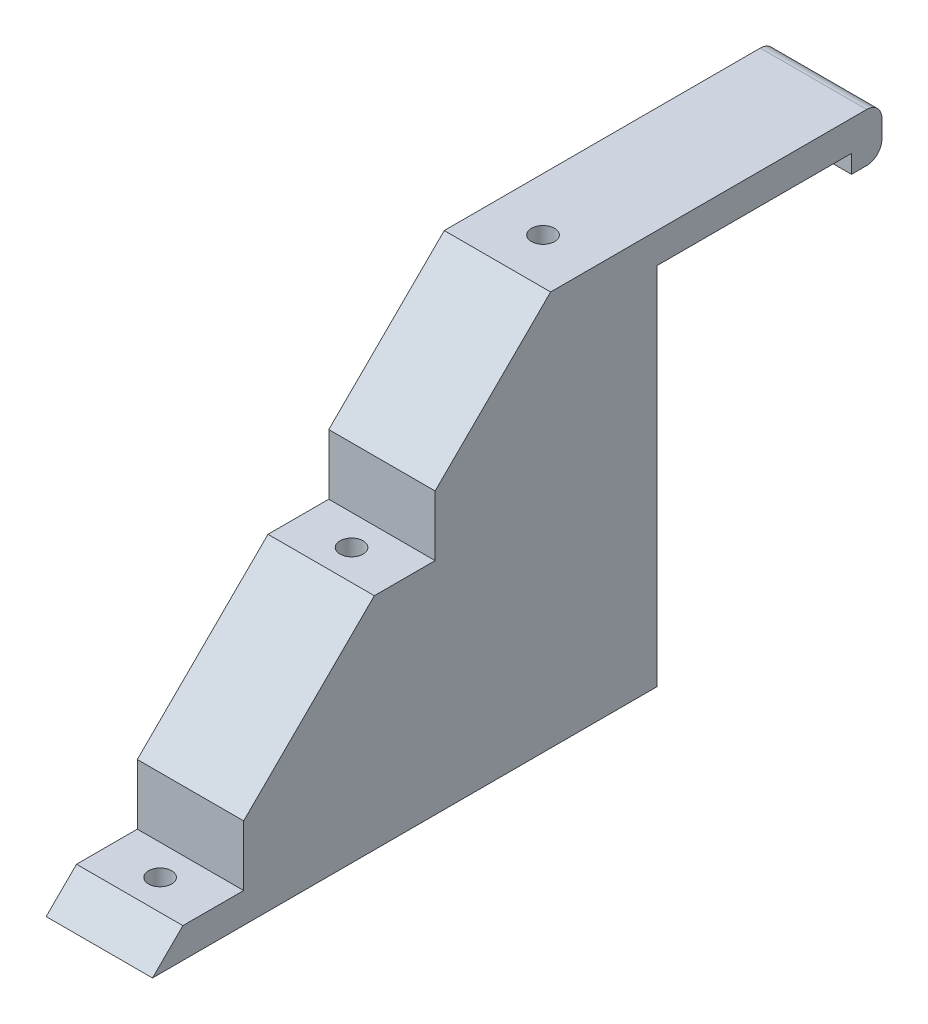
ISO-10303-21;
HEADER;
FILE_DESCRIPTION(('STEP AP214'),'2;1');
FILE_NAME('part.step','',(''),(''),'','','');
FILE_SCHEMA(('AUTOMOTIVE_DESIGN { 1 0 10303 214 1 1 1 1 }'));
ENDSEC;
DATA;
#1=APPLICATION_CONTEXT('core data for automotive mechanical design processes');
#2=APPLICATION_PROTOCOL_DEFINITION('international standard','automotive_design',2000,#1);
#3=PRODUCT_CONTEXT('',#1,'mechanical');
#4=PRODUCT('Part','Part','',(#3));
#5=PRODUCT_RELATED_PRODUCT_CATEGORY('part','',(#4));
#6=PRODUCT_DEFINITION_FORMATION('','',#4);
#7=PRODUCT_DEFINITION_CONTEXT('part definition',#1,'design');
#8=PRODUCT_DEFINITION('design','',#6,#7);
#9=PRODUCT_DEFINITION_SHAPE('','',#8);
#10=(LENGTH_UNIT() NAMED_UNIT(*) SI_UNIT(.MILLI.,.METRE.));
#11=(NAMED_UNIT(*) PLANE_ANGLE_UNIT() SI_UNIT($,.RADIAN.));
#12=(NAMED_UNIT(*) SI_UNIT($,.STERADIAN.) SOLID_ANGLE_UNIT());
#13=UNCERTAINTY_MEASURE_WITH_UNIT(LENGTH_MEASURE(1.E-05),#10,'distance_accuracy_value','');
#14=(GEOMETRIC_REPRESENTATION_CONTEXT(3) GLOBAL_UNCERTAINTY_ASSIGNED_CONTEXT((#13)) GLOBAL_UNIT_ASSIGNED_CONTEXT((#10,
#11,#12)) REPRESENTATION_CONTEXT('',''));
#15=CARTESIAN_POINT('',(0.,0.,0.));
#16=DIRECTION('',(0.,0.,1.));
#17=DIRECTION('',(1.,0.,0.));
#18=AXIS2_PLACEMENT_3D('',#15,#16,#17);
#19=CARTESIAN_POINT('',(-128.305702554585,6.34999999999999,22.225));
#20=DIRECTION('',(0.,0.709810792663124,0.704392389665695));
#21=DIRECTION('',(0.,-0.704392389665695,0.709810792663124));
#22=AXIS2_PLACEMENT_3D('',#19,#20,#21);
#23=PLANE('',#22);
#24=DIRECTION('',(-1.,0.,0.));
#25=VECTOR('',#24,1.);
#26=CARTESIAN_POINT('',(11.1125,-30.1988549618321,59.055));
#27=LINE('',#26,#25);
#28=CARTESIAN_POINT('',(11.1125,-30.1988549618321,59.055));
#29=VERTEX_POINT('',#28);
#30=CARTESIAN_POINT('',(-11.1125,-30.1988549618321,59.055));
#31=VERTEX_POINT('',#30);
#32=EDGE_CURVE('E160',#29,#31,#27,.T.);
#33=ORIENTED_EDGE('',*,*,#32,.T.);
#34=DIRECTION('',(0.,-0.704392389665695,0.709810792663124));
#35=VECTOR('',#34,1.);
#36=CARTESIAN_POINT('',(-11.1125,6.34999999999999,22.225));
#37=LINE('',#36,#35);
#38=CARTESIAN_POINT('',(-11.1125,-57.2954198473283,86.36));
#39=VERTEX_POINT('',#38);
#40=EDGE_CURVE('E226',#31,#39,#37,.T.);
#41=ORIENTED_EDGE('',*,*,#40,.T.);
#42=DIRECTION('',(-1.,0.,0.));
#43=VECTOR('',#42,1.);
#44=CARTESIAN_POINT('',(11.1125,-57.2954198473283,86.36));
#45=LINE('',#44,#43);
#46=CARTESIAN_POINT('',(11.1125,-57.2954198473282,86.36));
#47=VERTEX_POINT('',#46);
#48=EDGE_CURVE('E193',#47,#39,#45,.T.);
#49=ORIENTED_EDGE('',*,*,#48,.F.);
#50=DIRECTION('',(0.,-0.704392389665695,0.709810792663124));
#51=VECTOR('',#50,1.);
#52=CARTESIAN_POINT('',(11.1125,6.34999999999999,22.225));
#53=LINE('',#52,#51);
#54=EDGE_CURVE('E221',#29,#47,#53,.T.);
#55=ORIENTED_EDGE('',*,*,#54,.F.);
#56=EDGE_LOOP('',(#33,#41,#49,#55));
#57=FACE_BOUND('',#56,.T.);
#58=ADVANCED_FACE('F35',(#57),#23,.T.);
#59=DIRECTION('',(-1.,0.,0.));
#60=VECTOR('',#59,1.);
#61=CARTESIAN_POINT('',(11.1125,-69.8984732824427,99.06));
#62=LINE('',#61,#60);
#63=CARTESIAN_POINT('',(11.1125,-69.8984732824427,99.06));
#64=VERTEX_POINT('',#63);
#65=CARTESIAN_POINT('',(-11.1125,-69.8984732824427,99.06));
#66=VERTEX_POINT('',#65);
#67=EDGE_CURVE('E175',#64,#66,#62,.T.);
#68=ORIENTED_EDGE('',*,*,#67,.T.);
#69=CARTESIAN_POINT('',(-11.1125,-76.2,105.41));
#70=VERTEX_POINT('',#69);
#71=EDGE_CURVE('E220',#66,#70,#37,.T.);
#72=ORIENTED_EDGE('',*,*,#71,.T.);
#73=DIRECTION('',(1.,0.,0.));
#74=VECTOR('',#73,1.);
#75=CARTESIAN_POINT('',(-128.305702554585,-76.2,105.41));
#76=LINE('',#75,#74);
#77=CARTESIAN_POINT('',(11.1125,-76.2,105.41));
#78=VERTEX_POINT('',#77);
#79=EDGE_CURVE('E225',#70,#78,#76,.T.);
#80=ORIENTED_EDGE('',*,*,#79,.T.);
#81=EDGE_CURVE('E210',#64,#78,#53,.T.);
#82=ORIENTED_EDGE('',*,*,#81,.F.);
#83=EDGE_LOOP('',(#68,#72,#80,#82));
#84=FACE_BOUND('',#83,.T.);
#85=ADVANCED_FACE('F336',(#84),#23,.T.);
#86=CARTESIAN_POINT('',(11.1125,0.,-40.64));
#87=DIRECTION('',(0.,1.,0.));
#88=DIRECTION('',(0.,0.,1.));
#89=AXIS2_PLACEMENT_3D('',#86,#87,#88);
#90=PLANE('',#89);
#91=DIRECTION('',(1.,0.,0.));
#92=VECTOR('',#91,1.);
#93=CARTESIAN_POINT('',(-11.1125,0.,0.));
#94=LINE('',#93,#92);
#95=CARTESIAN_POINT('',(-11.1125,0.,0.));
#96=VERTEX_POINT('',#95);
#97=CARTESIAN_POINT('',(11.1125,0.,0.));
#98=VERTEX_POINT('',#97);
#99=EDGE_CURVE('E229',#96,#98,#94,.T.);
#100=ORIENTED_EDGE('',*,*,#99,.F.);
#101=DIRECTION('',(0.,0.,-1.));
#102=VECTOR('',#101,1.);
#103=CARTESIAN_POINT('',(-11.1125,0.,-40.64));
#104=LINE('',#103,#102);
#105=CARTESIAN_POINT('',(-11.1125,0.,-40.64));
#106=VERTEX_POINT('',#105);
#107=EDGE_CURVE('E246',#96,#106,#104,.T.);
#108=ORIENTED_EDGE('',*,*,#107,.T.);
#109=DIRECTION('',(-1.,0.,0.));
#110=VECTOR('',#109,1.);
#111=CARTESIAN_POINT('',(11.1125,0.,-40.64));
#112=LINE('',#111,#110);
#113=CARTESIAN_POINT('',(11.1125,0.,-40.64));
#114=VERTEX_POINT('',#113);
#115=EDGE_CURVE('E273',#114,#106,#112,.T.);
#116=ORIENTED_EDGE('',*,*,#115,.F.);
#117=DIRECTION('',(0.,0.,-1.));
#118=VECTOR('',#117,1.);
#119=CARTESIAN_POINT('',(11.1125,0.,0.));
#120=LINE('',#119,#118);
#121=EDGE_CURVE('E247',#98,#114,#120,.T.);
#122=ORIENTED_EDGE('',*,*,#121,.F.);
#123=EDGE_LOOP('',(#100,#108,#116,#122));
#124=FACE_BOUND('',#123,.T.);
#125=ADVANCED_FACE('F313',(#124),#90,.F.);
#126=CARTESIAN_POINT('',(11.1125,-3.81000000000001,-40.64));
#127=DIRECTION('',(0.,0.,-1.));
#128=DIRECTION('',(-1.,0.,0.));
#129=AXIS2_PLACEMENT_3D('',#126,#127,#128);
#130=PLANE('',#129);
#131=DIRECTION('',(0.,-1.,0.));
#132=VECTOR('',#131,1.);
#133=CARTESIAN_POINT('',(-11.1125,-3.81000000000001,-40.64));
#134=LINE('',#133,#132);
#135=CARTESIAN_POINT('',(-11.1125,-3.81000000000001,-40.64));
#136=VERTEX_POINT('',#135);
#137=EDGE_CURVE('E260',#106,#136,#134,.T.);
#138=ORIENTED_EDGE('',*,*,#137,.T.);
#139=DIRECTION('',(-1.,0.,0.));
#140=VECTOR('',#139,1.);
#141=CARTESIAN_POINT('',(11.1125,-3.81000000000001,-40.64));
#142=LINE('',#141,#140);
#143=CARTESIAN_POINT('',(11.1125,-3.81000000000001,-40.64));
#144=VERTEX_POINT('',#143);
#145=EDGE_CURVE('E270',#144,#136,#142,.T.);
#146=ORIENTED_EDGE('',*,*,#145,.F.);
#147=DIRECTION('',(0.,-1.,0.));
#148=VECTOR('',#147,1.);
#149=CARTESIAN_POINT('',(11.1125,-3.81000000000001,-40.64));
#150=LINE('',#149,#148);
#151=EDGE_CURVE('E249',#114,#144,#150,.T.);
#152=ORIENTED_EDGE('',*,*,#151,.F.);
#153=ORIENTED_EDGE('',*,*,#115,.T.);
#154=EDGE_LOOP('',(#138,#146,#152,#153));
#155=FACE_BOUND('',#154,.T.);
#156=ADVANCED_FACE('F307',(#155),#130,.F.);
#157=CARTESIAN_POINT('',(11.1125,-3.81000000000001,-46.99));
#158=DIRECTION('',(0.,1.,0.));
#159=DIRECTION('',(0.,0.,1.));
#160=AXIS2_PLACEMENT_3D('',#157,#158,#159);
#161=PLANE('',#160);
#162=DIRECTION('',(0.,0.,-1.));
#163=VECTOR('',#162,1.);
#164=CARTESIAN_POINT('',(-11.1125,-3.81000000000001,-46.99));
#165=LINE('',#164,#163);
#166=CARTESIAN_POINT('',(-11.1125,-3.81000000000001,-43.815));
#167=VERTEX_POINT('',#166);
#168=EDGE_CURVE('E262',#136,#167,#165,.T.);
#169=ORIENTED_EDGE('',*,*,#168,.T.);
#170=DIRECTION('',(-1.,0.,0.));
#171=VECTOR('',#170,1.);
#172=CARTESIAN_POINT('',(11.1125,-3.81000000000001,-43.815));
#173=LINE('',#172,#171);
#174=CARTESIAN_POINT('',(11.1125,-3.81000000000001,-43.815));
#175=VERTEX_POINT('',#174);
#176=EDGE_CURVE('E58',#167,#175,#173,.F.);
#177=ORIENTED_EDGE('',*,*,#176,.T.);
#178=DIRECTION('',(0.,0.,-1.));
#179=VECTOR('',#178,1.);
#180=CARTESIAN_POINT('',(11.1125,-3.81000000000001,-46.99));
#181=LINE('',#180,#179);
#182=EDGE_CURVE('E252',#144,#175,#181,.T.);
#183=ORIENTED_EDGE('',*,*,#182,.F.);
#184=ORIENTED_EDGE('',*,*,#145,.T.);
#185=EDGE_LOOP('',(#169,#177,#183,#184));
#186=FACE_BOUND('',#185,.T.);
#187=ADVANCED_FACE('F303',(#186),#161,.F.);
#188=CARTESIAN_POINT('',(11.1125,6.34999999999999,-46.99));
#189=DIRECTION('',(0.,0.,1.));
#190=DIRECTION('',(1.,0.,0.));
#191=AXIS2_PLACEMENT_3D('',#188,#189,#190);
#192=PLANE('',#191);
#193=DIRECTION('',(0.,1.,0.));
#194=VECTOR('',#193,1.);
#195=CARTESIAN_POINT('',(11.1125,6.34999999999999,-46.99));
#196=LINE('',#195,#194);
#197=CARTESIAN_POINT('',(11.1125,-0.635000000000006,-46.99));
#198=VERTEX_POINT('',#197);
#199=CARTESIAN_POINT('',(11.1125,3.17500000000001,-46.99));
#200=VERTEX_POINT('',#199);
#201=EDGE_CURVE('E254',#198,#200,#196,.T.);
#202=ORIENTED_EDGE('',*,*,#201,.F.);
#203=DIRECTION('',(-1.,0.,0.));
#204=VECTOR('',#203,1.);
#205=CARTESIAN_POINT('',(11.1125,-0.635000000000006,-46.99));
#206=LINE('',#205,#204);
#207=CARTESIAN_POINT('',(-11.1125,-0.635000000000006,-46.99));
#208=VERTEX_POINT('',#207);
#209=EDGE_CURVE('E282',#198,#208,#206,.T.);
#210=ORIENTED_EDGE('',*,*,#209,.T.);
#211=DIRECTION('',(0.,1.,0.));
#212=VECTOR('',#211,1.);
#213=CARTESIAN_POINT('',(-11.1125,6.34999999999999,-46.99));
#214=LINE('',#213,#212);
#215=CARTESIAN_POINT('',(-11.1125,3.17500000000001,-46.99));
#216=VERTEX_POINT('',#215);
#217=EDGE_CURVE('E264',#208,#216,#214,.T.);
#218=ORIENTED_EDGE('',*,*,#217,.T.);
#219=DIRECTION('',(-1.,0.,0.));
#220=VECTOR('',#219,1.);
#221=CARTESIAN_POINT('',(11.1125,3.17500000000001,-46.99));
#222=LINE('',#221,#220);
#223=EDGE_CURVE('E276',#216,#200,#222,.F.);
#224=ORIENTED_EDGE('',*,*,#223,.T.);
#225=EDGE_LOOP('',(#202,#210,#218,#224));
#226=FACE_BOUND('',#225,.T.);
#227=ADVANCED_FACE('F295',(#226),#192,.F.);
#228=CARTESIAN_POINT('',(11.1125,6.34999999999999,22.225));
#229=DIRECTION('',(0.,-1.,0.));
#230=DIRECTION('',(0.,0.,-1.));
#231=AXIS2_PLACEMENT_3D('',#228,#229,#230);
#232=PLANE('',#231);
#233=CARTESIAN_POINT('',(0.,6.34999999999999,12.7));
#234=DIRECTION('',(0.,-1.,0.));
#235=DIRECTION('',(0.,0.,-1.));
#236=AXIS2_PLACEMENT_3D('',#233,#234,#235);
#237=CIRCLE('',#236,2.413);
#238=CARTESIAN_POINT('',(0.,6.34999999999999,10.287));
#239=VERTEX_POINT('',#238);
#240=EDGE_CURVE('E211',#239,#239,#237,.T.);
#241=ORIENTED_EDGE('',*,*,#240,.T.);
#242=EDGE_LOOP('',(#241));
#243=FACE_BOUND('',#242,.T.);
#244=DIRECTION('',(0.,0.,1.));
#245=VECTOR('',#244,1.);
#246=CARTESIAN_POINT('',(11.1125,6.35,0.));
#247=LINE('',#246,#245);
#248=CARTESIAN_POINT('',(11.1125,6.34999999999999,-43.815));
#249=VERTEX_POINT('',#248);
#250=CARTESIAN_POINT('',(11.1125,6.34999999999999,22.225));
#251=VERTEX_POINT('',#250);
#252=EDGE_CURVE('E256',#249,#251,#247,.T.);
#253=ORIENTED_EDGE('',*,*,#252,.F.);
#254=DIRECTION('',(-1.,0.,0.));
#255=VECTOR('',#254,1.);
#256=CARTESIAN_POINT('',(11.1125,6.35000000000001,-43.815));
#257=LINE('',#256,#255);
#258=CARTESIAN_POINT('',(-11.1125,6.35000000000001,-43.815));
#259=VERTEX_POINT('',#258);
#260=EDGE_CURVE('E11',#249,#259,#257,.T.);
#261=ORIENTED_EDGE('',*,*,#260,.T.);
#262=DIRECTION('',(0.,0.,1.));
#263=VECTOR('',#262,1.);
#264=CARTESIAN_POINT('',(-11.1125,6.34999999999999,22.225));
#265=LINE('',#264,#263);
#266=CARTESIAN_POINT('',(-11.1125,6.35,22.225));
#267=VERTEX_POINT('',#266);
#268=EDGE_CURVE('E250',#259,#267,#265,.T.);
#269=ORIENTED_EDGE('',*,*,#268,.T.);
#270=DIRECTION('',(-1.,0.,0.));
#271=VECTOR('',#270,1.);
#272=CARTESIAN_POINT('',(11.1125,6.34999999999999,22.225));
#273=LINE('',#272,#271);
#274=EDGE_CURVE('E258',#251,#267,#273,.T.);
#275=ORIENTED_EDGE('',*,*,#274,.F.);
#276=EDGE_LOOP('',(#253,#261,#269,#275));
#277=FACE_BOUND('',#276,.T.);
#278=ADVANCED_FACE('F361',(#243,#277),#232,.F.);
#279=CARTESIAN_POINT('',(11.1125,0.,0.));
#280=DIRECTION('',(-1.,0.,0.));
#281=DIRECTION('',(0.,0.,1.));
#282=AXIS2_PLACEMENT_3D('',#279,#280,#281);
#283=PLANE('',#282);
#284=ORIENTED_EDGE('',*,*,#182,.T.);
#285=CARTESIAN_POINT('',(11.1125,-0.635000000000006,-43.815));
#286=DIRECTION('',(-1.,0.,0.));
#287=DIRECTION('',(0.,0.,1.));
#288=AXIS2_PLACEMENT_3D('',#285,#286,#287);
#289=CIRCLE('',#288,3.175);
#290=EDGE_CURVE('E43',#175,#198,#289,.F.);
#291=ORIENTED_EDGE('',*,*,#290,.T.);
#292=ORIENTED_EDGE('',*,*,#201,.T.);
#293=CARTESIAN_POINT('',(11.1125,3.17500000000001,-43.815));
#294=DIRECTION('',(-1.,0.,0.));
#295=DIRECTION('',(0.,0.,1.));
#296=AXIS2_PLACEMENT_3D('',#293,#294,#295);
#297=CIRCLE('',#296,3.175);
#298=EDGE_CURVE('E50',#200,#249,#297,.F.);
#299=ORIENTED_EDGE('',*,*,#298,.T.);
#300=ORIENTED_EDGE('',*,*,#252,.T.);
#301=CARTESIAN_POINT('',(11.1125,-17.5958015267175,46.355));
#302=VERTEX_POINT('',#301);
#303=EDGE_CURVE('E174',#251,#302,#53,.T.);
#304=ORIENTED_EDGE('',*,*,#303,.T.);
#305=DIRECTION('',(0.,-1.,0.));
#306=VECTOR('',#305,1.);
#307=CARTESIAN_POINT('',(11.1125,-17.5958015267176,46.355));
#308=LINE('',#307,#306);
#309=CARTESIAN_POINT('',(11.1125,-30.1988549618321,46.355));
#310=VERTEX_POINT('',#309);
#311=EDGE_CURVE('E154',#302,#310,#308,.T.);
#312=ORIENTED_EDGE('',*,*,#311,.T.);
#313=DIRECTION('',(0.,0.,1.));
#314=VECTOR('',#313,1.);
#315=CARTESIAN_POINT('',(11.1125,-30.1988549618321,46.355));
#316=LINE('',#315,#314);
#317=EDGE_CURVE('E164',#310,#29,#316,.T.);
#318=ORIENTED_EDGE('',*,*,#317,.T.);
#319=ORIENTED_EDGE('',*,*,#54,.T.);
#320=DIRECTION('',(0.,-1.,0.));
#321=VECTOR('',#320,1.);
#322=CARTESIAN_POINT('',(11.1125,-57.2954198473283,86.36));
#323=LINE('',#322,#321);
#324=CARTESIAN_POINT('',(11.1125,-69.8984732824427,86.36));
#325=VERTEX_POINT('',#324);
#326=EDGE_CURVE('E187',#47,#325,#323,.T.);
#327=ORIENTED_EDGE('',*,*,#326,.T.);
#328=DIRECTION('',(0.,0.,1.));
#329=VECTOR('',#328,1.);
#330=CARTESIAN_POINT('',(11.1125,-69.8984732824427,86.36));
#331=LINE('',#330,#329);
#332=EDGE_CURVE('E190',#325,#64,#331,.T.);
#333=ORIENTED_EDGE('',*,*,#332,.T.);
#334=ORIENTED_EDGE('',*,*,#81,.T.);
#335=DIRECTION('',(0.,0.,1.));
#336=VECTOR('',#335,1.);
#337=CARTESIAN_POINT('',(11.1125,-76.2,22.225));
#338=LINE('',#337,#336);
#339=CARTESIAN_POINT('',(11.1125,-76.2,0.));
#340=VERTEX_POINT('',#339);
#341=EDGE_CURVE('E235',#340,#78,#338,.T.);
#342=ORIENTED_EDGE('',*,*,#341,.F.);
#343=DIRECTION('',(0.,1.,0.));
#344=VECTOR('',#343,1.);
#345=CARTESIAN_POINT('',(11.1125,-76.2,0.));
#346=LINE('',#345,#344);
#347=EDGE_CURVE('E238',#340,#98,#346,.T.);
#348=ORIENTED_EDGE('',*,*,#347,.T.);
#349=ORIENTED_EDGE('',*,*,#121,.T.);
#350=ORIENTED_EDGE('',*,*,#151,.T.);
#351=EDGE_LOOP('',(#284,#291,#292,#299,#300,#304,#312,#318,#319,#327,#333,#334,#342,#348,#349,#350));
#352=FACE_BOUND('',#351,.T.);
#353=ADVANCED_FACE('F172',(#352),#283,.F.);
#354=CARTESIAN_POINT('',(-11.1125,0.,0.));
#355=DIRECTION('',(-1.,0.,0.));
#356=DIRECTION('',(0.,0.,1.));
#357=AXIS2_PLACEMENT_3D('',#354,#355,#356);
#358=PLANE('',#357);
#359=ORIENTED_EDGE('',*,*,#217,.F.);
#360=CARTESIAN_POINT('',(-11.1125,-0.635000000000006,-43.815));
#361=DIRECTION('',(-1.,0.,0.));
#362=DIRECTION('',(0.,0.,1.));
#363=AXIS2_PLACEMENT_3D('',#360,#361,#362);
#364=CIRCLE('',#363,3.175);
#365=EDGE_CURVE('E287',#208,#167,#364,.T.);
#366=ORIENTED_EDGE('',*,*,#365,.T.);
#367=ORIENTED_EDGE('',*,*,#168,.F.);
#368=ORIENTED_EDGE('',*,*,#137,.F.);
#369=ORIENTED_EDGE('',*,*,#107,.F.);
#370=DIRECTION('',(0.,1.,0.));
#371=VECTOR('',#370,1.);
#372=CARTESIAN_POINT('',(-11.1125,-76.2,0.));
#373=LINE('',#372,#371);
#374=CARTESIAN_POINT('',(-11.1125,-76.2,0.));
#375=VERTEX_POINT('',#374);
#376=EDGE_CURVE('E243',#375,#96,#373,.T.);
#377=ORIENTED_EDGE('',*,*,#376,.F.);
#378=DIRECTION('',(0.,0.,-1.));
#379=VECTOR('',#378,1.);
#380=CARTESIAN_POINT('',(-11.1125,-76.2,22.225));
#381=LINE('',#380,#379);
#382=EDGE_CURVE('E230',#70,#375,#381,.T.);
#383=ORIENTED_EDGE('',*,*,#382,.F.);
#384=ORIENTED_EDGE('',*,*,#71,.F.);
#385=DIRECTION('',(0.,0.,1.));
#386=VECTOR('',#385,1.);
#387=CARTESIAN_POINT('',(-11.1125,-69.8984732824427,0.));
#388=LINE('',#387,#386);
#389=CARTESIAN_POINT('',(-11.1125,-69.8984732824427,86.36));
#390=VERTEX_POINT('',#389);
#391=EDGE_CURVE('E198',#390,#66,#388,.T.);
#392=ORIENTED_EDGE('',*,*,#391,.F.);
#393=DIRECTION('',(0.,-1.,0.));
#394=VECTOR('',#393,1.);
#395=CARTESIAN_POINT('',(-11.1125,0.,86.3600000000001));
#396=LINE('',#395,#394);
#397=EDGE_CURVE('E203',#39,#390,#396,.T.);
#398=ORIENTED_EDGE('',*,*,#397,.F.);
#399=ORIENTED_EDGE('',*,*,#40,.F.);
#400=DIRECTION('',(0.,0.,1.));
#401=VECTOR('',#400,1.);
#402=CARTESIAN_POINT('',(-11.1125,-30.1988549618321,0.));
#403=LINE('',#402,#401);
#404=CARTESIAN_POINT('',(-11.1125,-30.1988549618321,46.355));
#405=VERTEX_POINT('',#404);
#406=EDGE_CURVE('E201',#405,#31,#403,.T.);
#407=ORIENTED_EDGE('',*,*,#406,.F.);
#408=DIRECTION('',(0.,-1.,0.));
#409=VECTOR('',#408,1.);
#410=CARTESIAN_POINT('',(-11.1125,0.,46.355));
#411=LINE('',#410,#409);
#412=CARTESIAN_POINT('',(-11.1125,-17.5958015267176,46.355));
#413=VERTEX_POINT('',#412);
#414=EDGE_CURVE('E157',#413,#405,#411,.T.);
#415=ORIENTED_EDGE('',*,*,#414,.F.);
#416=EDGE_CURVE('E222',#267,#413,#37,.T.);
#417=ORIENTED_EDGE('',*,*,#416,.F.);
#418=ORIENTED_EDGE('',*,*,#268,.F.);
#419=CARTESIAN_POINT('',(-11.1125,3.17500000000001,-43.815));
#420=DIRECTION('',(-1.,0.,0.));
#421=DIRECTION('',(0.,0.,1.));
#422=AXIS2_PLACEMENT_3D('',#419,#420,#421);
#423=CIRCLE('',#422,3.175);
#424=EDGE_CURVE('E285',#259,#216,#423,.T.);
#425=ORIENTED_EDGE('',*,*,#424,.T.);
#426=EDGE_LOOP('',(#359,#366,#367,#368,#369,#377,#383,#384,#392,#398,#399,#407,#415,#417,#418,#425));
#427=FACE_BOUND('',#426,.T.);
#428=ADVANCED_FACE('F301',(#427),#358,.T.);
#429=CARTESIAN_POINT('',(-11.1125,-76.2,0.));
#430=DIRECTION('',(0.,0.,1.));
#431=DIRECTION('',(0.,-1.,0.));
#432=AXIS2_PLACEMENT_3D('',#429,#430,#431);
#433=PLANE('',#432);
#434=CARTESIAN_POINT('',(0.,-52.3875,0.));
#435=DIRECTION('',(0.,0.,-1.));
#436=DIRECTION('',(0.,1.,0.));
#437=AXIS2_PLACEMENT_3D('',#434,#435,#436);
#438=CIRCLE('',#437,3.175);
#439=CARTESIAN_POINT('',(0.,-49.2125,0.));
#440=VERTEX_POINT('',#439);
#441=EDGE_CURVE('E181',#440,#440,#438,.T.);
#442=ORIENTED_EDGE('',*,*,#441,.F.);
#443=EDGE_LOOP('',(#442));
#444=FACE_BOUND('',#443,.T.);
#445=ORIENTED_EDGE('',*,*,#99,.T.);
#446=ORIENTED_EDGE('',*,*,#347,.F.);
#447=DIRECTION('',(1.,0.,0.));
#448=VECTOR('',#447,1.);
#449=CARTESIAN_POINT('',(-11.1125,-76.2,0.));
#450=LINE('',#449,#448);
#451=EDGE_CURVE('E233',#375,#340,#450,.T.);
#452=ORIENTED_EDGE('',*,*,#451,.F.);
#453=ORIENTED_EDGE('',*,*,#376,.T.);
#454=EDGE_LOOP('',(#445,#446,#452,#453));
#455=FACE_BOUND('',#454,.T.);
#456=ADVANCED_FACE('F316',(#444,#455),#433,.F.);
#457=CARTESIAN_POINT('',(0.,-76.2,0.));
#458=DIRECTION('',(0.,-1.,0.));
#459=DIRECTION('',(0.,0.,-1.));
#460=AXIS2_PLACEMENT_3D('',#457,#458,#459);
#461=PLANE('',#460);
#462=CARTESIAN_POINT('',(0.,-76.2,92.71));
#463=DIRECTION('',(0.,-1.,0.));
#464=DIRECTION('',(0.,0.,-1.));
#465=AXIS2_PLACEMENT_3D('',#462,#463,#464);
#466=CIRCLE('',#465,2.413);
#467=CARTESIAN_POINT('',(0.,-76.2,90.297));
#468=VERTEX_POINT('',#467);
#469=EDGE_CURVE('E207',#468,#468,#466,.T.);
#470=ORIENTED_EDGE('',*,*,#469,.F.);
#471=EDGE_LOOP('',(#470));
#472=FACE_BOUND('',#471,.T.);
#473=CARTESIAN_POINT('',(0.,-76.2,12.7));
#474=DIRECTION('',(0.,-1.,0.));
#475=DIRECTION('',(0.,0.,-1.));
#476=AXIS2_PLACEMENT_3D('',#473,#474,#475);
#477=CIRCLE('',#476,2.413);
#478=CARTESIAN_POINT('',(0.,-76.2,10.287));
#479=VERTEX_POINT('',#478);
#480=EDGE_CURVE('E214',#479,#479,#477,.T.);
#481=ORIENTED_EDGE('',*,*,#480,.F.);
#482=EDGE_LOOP('',(#481));
#483=FACE_BOUND('',#482,.T.);
#484=CARTESIAN_POINT('',(0.,-76.2,52.705));
#485=DIRECTION('',(0.,-1.,0.));
#486=DIRECTION('',(0.,0.,-1.));
#487=AXIS2_PLACEMENT_3D('',#484,#485,#486);
#488=CIRCLE('',#487,2.413);
#489=CARTESIAN_POINT('',(0.,-76.2,50.292));
#490=VERTEX_POINT('',#489);
#491=EDGE_CURVE('E206',#490,#490,#488,.T.);
#492=ORIENTED_EDGE('',*,*,#491,.F.);
#493=EDGE_LOOP('',(#492));
#494=FACE_BOUND('',#493,.T.);
#495=ORIENTED_EDGE('',*,*,#382,.T.);
#496=ORIENTED_EDGE('',*,*,#451,.T.);
#497=ORIENTED_EDGE('',*,*,#341,.T.);
#498=ORIENTED_EDGE('',*,*,#79,.F.);
#499=EDGE_LOOP('',(#495,#496,#497,#498));
#500=FACE_BOUND('',#499,.T.);
#501=ADVANCED_FACE('F320',(#472,#483,#494,#500),#461,.T.);
#502=DIRECTION('',(-1.,0.,0.));
#503=VECTOR('',#502,1.);
#504=CARTESIAN_POINT('',(11.1125,-17.5958015267176,46.355));
#505=LINE('',#504,#503);
#506=EDGE_CURVE('E161',#302,#413,#505,.T.);
#507=ORIENTED_EDGE('',*,*,#506,.F.);
#508=ORIENTED_EDGE('',*,*,#303,.F.);
#509=ORIENTED_EDGE('',*,*,#274,.T.);
#510=ORIENTED_EDGE('',*,*,#416,.T.);
#511=EDGE_LOOP('',(#507,#508,#509,#510));
#512=FACE_BOUND('',#511,.T.);
#513=ADVANCED_FACE('F339',(#512),#23,.T.);
#514=CARTESIAN_POINT('',(0.,6.34999999999999,52.705));
#515=DIRECTION('',(0.,-1.,0.));
#516=DIRECTION('',(0.,0.,-1.));
#517=AXIS2_PLACEMENT_3D('',#514,#515,#516);
#518=CYLINDRICAL_SURFACE('',#517,2.413);
#519=CARTESIAN_POINT('',(0.,-30.1988549618321,52.705));
#520=DIRECTION('',(0.,-1.,0.));
#521=DIRECTION('',(0.,0.,-1.));
#522=AXIS2_PLACEMENT_3D('',#519,#520,#521);
#523=CIRCLE('',#522,2.413);
#524=CARTESIAN_POINT('',(0.,-30.1988549618321,50.292));
#525=VERTEX_POINT('',#524);
#526=EDGE_CURVE('E200',#525,#525,#523,.F.);
#527=ORIENTED_EDGE('',*,*,#526,.T.);
#528=EDGE_LOOP('',(#527));
#529=FACE_BOUND('',#528,.T.);
#530=ORIENTED_EDGE('',*,*,#491,.T.);
#531=EDGE_LOOP('',(#530));
#532=FACE_BOUND('',#531,.T.);
#533=ADVANCED_FACE('F348',(#529,#532),#518,.F.);
#534=CARTESIAN_POINT('',(0.,6.34999999999999,92.71));
#535=DIRECTION('',(0.,-1.,0.));
#536=DIRECTION('',(0.,0.,-1.));
#537=AXIS2_PLACEMENT_3D('',#534,#535,#536);
#538=CYLINDRICAL_SURFACE('',#537,2.413);
#539=CARTESIAN_POINT('',(0.,-69.8984732824427,92.71));
#540=DIRECTION('',(0.,-1.,0.));
#541=DIRECTION('',(0.,0.,-1.));
#542=AXIS2_PLACEMENT_3D('',#539,#540,#541);
#543=CIRCLE('',#542,2.413);
#544=CARTESIAN_POINT('',(0.,-69.8984732824427,90.297));
#545=VERTEX_POINT('',#544);
#546=EDGE_CURVE('E184',#545,#545,#543,.F.);
#547=ORIENTED_EDGE('',*,*,#546,.T.);
#548=EDGE_LOOP('',(#547));
#549=FACE_BOUND('',#548,.T.);
#550=ORIENTED_EDGE('',*,*,#469,.T.);
#551=EDGE_LOOP('',(#550));
#552=FACE_BOUND('',#551,.T.);
#553=ADVANCED_FACE('F354',(#549,#552),#538,.F.);
#554=CARTESIAN_POINT('',(0.,6.34999999999999,12.7));
#555=DIRECTION('',(0.,-1.,0.));
#556=DIRECTION('',(0.,0.,-1.));
#557=AXIS2_PLACEMENT_3D('',#554,#555,#556);
#558=CYLINDRICAL_SURFACE('',#557,2.413);
#559=ORIENTED_EDGE('',*,*,#240,.F.);
#560=EDGE_LOOP('',(#559));
#561=FACE_BOUND('',#560,.T.);
#562=ORIENTED_EDGE('',*,*,#480,.T.);
#563=EDGE_LOOP('',(#562));
#564=FACE_BOUND('',#563,.T.);
#565=ADVANCED_FACE('F410',(#561,#564),#558,.F.);
#566=CARTESIAN_POINT('',(11.1125,-69.8984732824427,86.36));
#567=DIRECTION('',(0.,-1.,0.));
#568=DIRECTION('',(0.,0.,-1.));
#569=AXIS2_PLACEMENT_3D('',#566,#567,#568);
#570=PLANE('',#569);
#571=ORIENTED_EDGE('',*,*,#391,.T.);
#572=ORIENTED_EDGE('',*,*,#67,.F.);
#573=ORIENTED_EDGE('',*,*,#332,.F.);
#574=DIRECTION('',(-1.,0.,0.));
#575=VECTOR('',#574,1.);
#576=CARTESIAN_POINT('',(11.1125,-69.8984732824427,86.36));
#577=LINE('',#576,#575);
#578=EDGE_CURVE('E178',#325,#390,#577,.T.);
#579=ORIENTED_EDGE('',*,*,#578,.T.);
#580=EDGE_LOOP('',(#571,#572,#573,#579));
#581=FACE_BOUND('',#580,.T.);
#582=ORIENTED_EDGE('',*,*,#546,.F.);
#583=EDGE_LOOP('',(#582));
#584=FACE_BOUND('',#583,.T.);
#585=ADVANCED_FACE('F333',(#581,#584),#570,.F.);
#586=CARTESIAN_POINT('',(11.1125,-57.2954198473283,86.36));
#587=DIRECTION('',(0.,0.,-1.));
#588=DIRECTION('',(0.,1.,0.));
#589=AXIS2_PLACEMENT_3D('',#586,#587,#588);
#590=PLANE('',#589);
#591=ORIENTED_EDGE('',*,*,#397,.T.);
#592=ORIENTED_EDGE('',*,*,#578,.F.);
#593=ORIENTED_EDGE('',*,*,#326,.F.);
#594=ORIENTED_EDGE('',*,*,#48,.T.);
#595=EDGE_LOOP('',(#591,#592,#593,#594));
#596=FACE_BOUND('',#595,.T.);
#597=ADVANCED_FACE('F330',(#596),#590,.F.);
#598=CARTESIAN_POINT('',(11.1125,-30.1988549618321,46.355));
#599=DIRECTION('',(0.,-1.,0.));
#600=DIRECTION('',(0.,0.,-1.));
#601=AXIS2_PLACEMENT_3D('',#598,#599,#600);
#602=PLANE('',#601);
#603=ORIENTED_EDGE('',*,*,#406,.T.);
#604=ORIENTED_EDGE('',*,*,#32,.F.);
#605=ORIENTED_EDGE('',*,*,#317,.F.);
#606=DIRECTION('',(-1.,0.,0.));
#607=VECTOR('',#606,1.);
#608=CARTESIAN_POINT('',(11.1125,-30.1988549618321,46.355));
#609=LINE('',#608,#607);
#610=EDGE_CURVE('E150',#310,#405,#609,.T.);
#611=ORIENTED_EDGE('',*,*,#610,.T.);
#612=EDGE_LOOP('',(#603,#604,#605,#611));
#613=FACE_BOUND('',#612,.T.);
#614=ORIENTED_EDGE('',*,*,#526,.F.);
#615=EDGE_LOOP('',(#614));
#616=FACE_BOUND('',#615,.T.);
#617=ADVANCED_FACE('F165',(#613,#616),#602,.F.);
#618=CARTESIAN_POINT('',(11.1125,-17.5958015267176,46.355));
#619=DIRECTION('',(0.,0.,-1.));
#620=DIRECTION('',(0.,1.,0.));
#621=AXIS2_PLACEMENT_3D('',#618,#619,#620);
#622=PLANE('',#621);
#623=ORIENTED_EDGE('',*,*,#414,.T.);
#624=ORIENTED_EDGE('',*,*,#610,.F.);
#625=ORIENTED_EDGE('',*,*,#311,.F.);
#626=ORIENTED_EDGE('',*,*,#506,.T.);
#627=EDGE_LOOP('',(#623,#624,#625,#626));
#628=FACE_BOUND('',#627,.T.);
#629=ADVANCED_FACE('F152',(#628),#622,.F.);
#630=CARTESIAN_POINT('',(11.1125,-0.635000000000006,-43.815));
#631=DIRECTION('',(-1.,0.,0.));
#632=DIRECTION('',(0.,0.,1.));
#633=AXIS2_PLACEMENT_3D('',#630,#631,#632);
#634=CYLINDRICAL_SURFACE('',#633,3.175);
#635=ORIENTED_EDGE('',*,*,#290,.F.);
#636=ORIENTED_EDGE('',*,*,#176,.F.);
#637=ORIENTED_EDGE('',*,*,#365,.F.);
#638=ORIENTED_EDGE('',*,*,#209,.F.);
#639=EDGE_LOOP('',(#635,#636,#637,#638));
#640=FACE_BOUND('',#639,.T.);
#641=ADVANCED_FACE('F298',(#640),#634,.T.);
#642=CARTESIAN_POINT('',(11.1125,3.17500000000001,-43.815));
#643=DIRECTION('',(-1.,0.,0.));
#644=DIRECTION('',(0.,0.,1.));
#645=AXIS2_PLACEMENT_3D('',#642,#643,#644);
#646=CYLINDRICAL_SURFACE('',#645,3.175);
#647=ORIENTED_EDGE('',*,*,#298,.F.);
#648=ORIENTED_EDGE('',*,*,#223,.F.);
#649=ORIENTED_EDGE('',*,*,#424,.F.);
#650=ORIENTED_EDGE('',*,*,#260,.F.);
#651=EDGE_LOOP('',(#647,#648,#649,#650));
#652=FACE_BOUND('',#651,.T.);
#653=ADVANCED_FACE('F37',(#652),#646,.T.);
#654=CARTESIAN_POINT('',(0.,-52.3875,9.525));
#655=DIRECTION('',(0.,0.,-1.));
#656=DIRECTION('',(0.,1.,0.));
#657=AXIS2_PLACEMENT_3D('',#654,#655,#656);
#658=CYLINDRICAL_SURFACE('',#657,3.175);
#659=CARTESIAN_POINT('',(0.,-52.3875,9.525));
#660=DIRECTION('',(0.,0.,-1.));
#661=DIRECTION('',(0.,1.,0.));
#662=AXIS2_PLACEMENT_3D('',#659,#660,#661);
#663=CIRCLE('',#662,3.175);
#664=CARTESIAN_POINT('',(0.,-49.2125,9.525));
#665=VERTEX_POINT('',#664);
#666=EDGE_CURVE('E191',#665,#665,#663,.T.);
#667=ORIENTED_EDGE('',*,*,#666,.F.);
#668=EDGE_LOOP('',(#667));
#669=FACE_BOUND('',#668,.T.);
#670=ORIENTED_EDGE('',*,*,#441,.T.);
#671=EDGE_LOOP('',(#670));
#672=FACE_BOUND('',#671,.T.);
#673=ADVANCED_FACE('F365',(#669,#672),#658,.F.);
#674=CARTESIAN_POINT('',(0.,-52.3875,9.525));
#675=DIRECTION('',(0.,0.,-1.));
#676=DIRECTION('',(0.,1.,0.));
#677=AXIS2_PLACEMENT_3D('',#674,#675,#676);
#678=PLANE('',#677);
#679=ORIENTED_EDGE('',*,*,#666,.T.);
#680=EDGE_LOOP('',(#679));
#681=FACE_BOUND('',#680,.T.);
#682=ADVANCED_FACE('F370',(#681),#678,.T.);
#683=CLOSED_SHELL('',(#58,#85,#125,#156,#187,#227,#278,#353,#428,#456,#501,#513,#533,#553,#565,
#585,#597,#617,#629,#641,#653,#673,#682));
#684=MANIFOLD_SOLID_BREP('B2',#683);
#685=ADVANCED_BREP_SHAPE_REPRESENTATION('',(#18,#684),#14);
#686=SHAPE_DEFINITION_REPRESENTATION(#9,#685);
ENDSEC;
END-ISO-10303-21;
